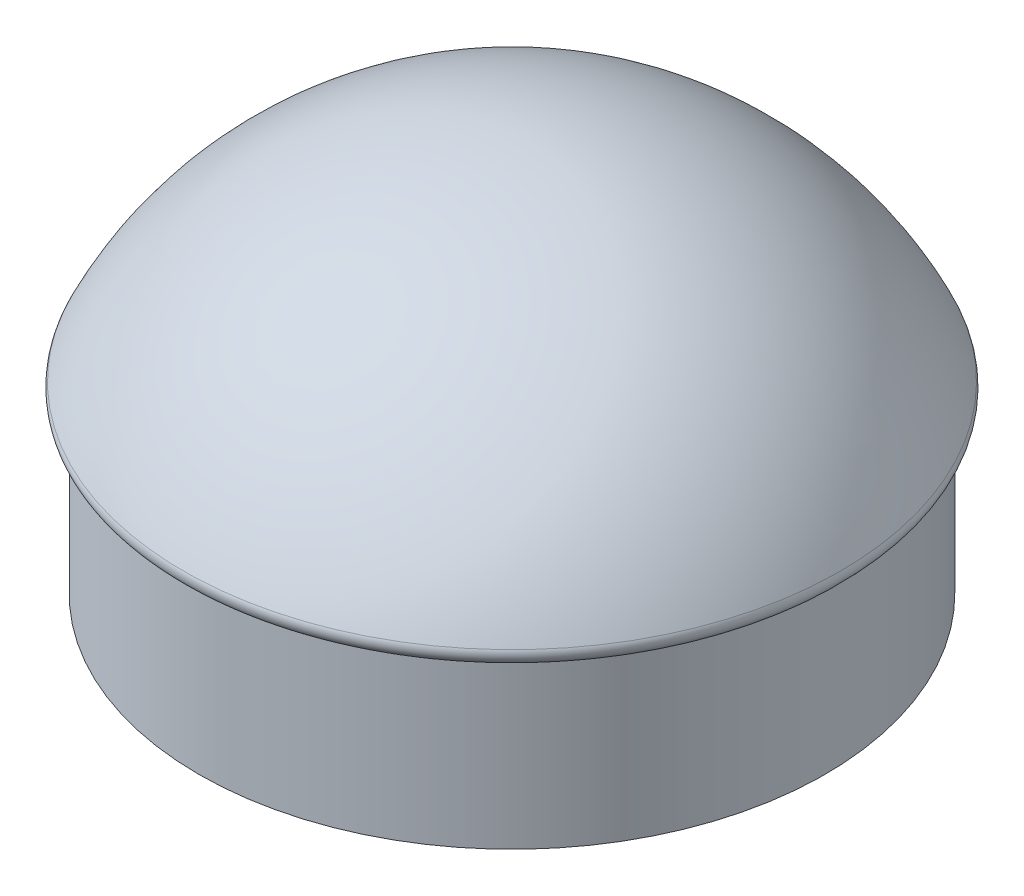
ISO-10303-21;
HEADER;
FILE_DESCRIPTION(('STEP AP214'),'2;1');
FILE_NAME('part.step','',(''),(''),'','','');
FILE_SCHEMA(('AUTOMOTIVE_DESIGN { 1 0 10303 214 1 1 1 1 }'));
ENDSEC;
DATA;
#1=APPLICATION_CONTEXT('core data for automotive mechanical design processes');
#2=APPLICATION_PROTOCOL_DEFINITION('international standard','automotive_design',2000,#1);
#3=PRODUCT_CONTEXT('',#1,'mechanical');
#4=PRODUCT('Part','Part','',(#3));
#5=PRODUCT_RELATED_PRODUCT_CATEGORY('part','',(#4));
#6=PRODUCT_DEFINITION_FORMATION('','',#4);
#7=PRODUCT_DEFINITION_CONTEXT('part definition',#1,'design');
#8=PRODUCT_DEFINITION('design','',#6,#7);
#9=PRODUCT_DEFINITION_SHAPE('','',#8);
#10=(LENGTH_UNIT() NAMED_UNIT(*) SI_UNIT(.MILLI.,.METRE.));
#11=(NAMED_UNIT(*) PLANE_ANGLE_UNIT() SI_UNIT($,.RADIAN.));
#12=(NAMED_UNIT(*) SI_UNIT($,.STERADIAN.) SOLID_ANGLE_UNIT());
#13=UNCERTAINTY_MEASURE_WITH_UNIT(LENGTH_MEASURE(1.E-05),#10,'distance_accuracy_value','');
#14=(GEOMETRIC_REPRESENTATION_CONTEXT(3) GLOBAL_UNCERTAINTY_ASSIGNED_CONTEXT((#13)) GLOBAL_UNIT_ASSIGNED_CONTEXT((#10,
#11,#12)) REPRESENTATION_CONTEXT('',''));
#15=CARTESIAN_POINT('',(0.,0.,0.));
#16=DIRECTION('',(0.,0.,1.));
#17=DIRECTION('',(1.,0.,0.));
#18=AXIS2_PLACEMENT_3D('',#15,#16,#17);
#19=CARTESIAN_POINT('',(0.,75.,0.));
#20=DIRECTION('',(0.,-1.,0.));
#21=DIRECTION('',(0.,0.,-1.));
#22=AXIS2_PLACEMENT_3D('',#19,#20,#21);
#23=CYLINDRICAL_SURFACE('',#22,140.);
#24=CARTESIAN_POINT('',(0.,75.,0.));
#25=DIRECTION('',(0.,1.,0.));
#26=DIRECTION('',(0.,0.,1.));
#27=AXIS2_PLACEMENT_3D('',#24,#25,#26);
#28=CIRCLE('',#27,140.);
#29=CARTESIAN_POINT('',(0.,75.,140.));
#30=VERTEX_POINT('',#29);
#31=EDGE_CURVE('E11',#30,#30,#28,.T.);
#32=ORIENTED_EDGE('',*,*,#31,.F.);
#33=EDGE_LOOP('',(#32));
#34=FACE_BOUND('',#33,.T.);
#35=CARTESIAN_POINT('',(0.,0.,0.));
#36=DIRECTION('',(0.,1.,0.));
#37=DIRECTION('',(0.,0.,1.));
#38=AXIS2_PLACEMENT_3D('',#35,#36,#37);
#39=CIRCLE('',#38,140.);
#40=CARTESIAN_POINT('',(0.,0.,140.));
#41=VERTEX_POINT('',#40);
#42=EDGE_CURVE('E50',#41,#41,#39,.T.);
#43=ORIENTED_EDGE('',*,*,#42,.T.);
#44=EDGE_LOOP('',(#43));
#45=FACE_BOUND('',#44,.T.);
#46=ADVANCED_FACE('F47',(#34,#45),#23,.T.);
#47=CARTESIAN_POINT('',(0.,0.,0.));
#48=DIRECTION('',(0.,1.,0.));
#49=DIRECTION('',(0.,0.,1.));
#50=AXIS2_PLACEMENT_3D('',#47,#48,#49);
#51=PLANE('',#50);
#52=ORIENTED_EDGE('',*,*,#42,.F.);
#53=EDGE_LOOP('',(#52));
#54=FACE_BOUND('',#53,.T.);
#55=ADVANCED_FACE('F70',(#54),#51,.F.);
#56=CARTESIAN_POINT('',(0.,75.,0.));
#57=DIRECTION('',(0.,-1.,0.));
#58=DIRECTION('',(0.,0.,-1.));
#59=AXIS2_PLACEMENT_3D('',#56,#57,#58);
#60=PLANE('',#59);
#61=ORIENTED_EDGE('',*,*,#31,.T.);
#62=EDGE_LOOP('',(#61));
#63=FACE_BOUND('',#62,.T.);
#64=CARTESIAN_POINT('',(0.,75.,0.));
#65=DIRECTION('',(0.,-1.,0.));
#66=DIRECTION('',(0.,0.,-1.));
#67=AXIS2_PLACEMENT_3D('',#64,#65,#66);
#68=CIRCLE('',#67,142.327267003282);
#69=CARTESIAN_POINT('',(0.,75.,-142.327267003282));
#70=VERTEX_POINT('',#69);
#71=EDGE_CURVE('E81',#70,#70,#68,.T.);
#72=ORIENTED_EDGE('',*,*,#71,.T.);
#73=EDGE_LOOP('',(#72));
#74=FACE_BOUND('',#73,.T.);
#75=ADVANCED_FACE('F65',(#63,#74),#60,.T.);
#76=CARTESIAN_POINT('',(0.,80.,0.));
#77=DIRECTION('',(0.,-1.,0.));
#78=DIRECTION('',(0.,0.,-1.));
#79=AXIS2_PLACEMENT_3D('',#76,#77,#78);
#80=TOROIDAL_SURFACE('',#79,142.327267003282,5.00000000000006);
#81=CARTESIAN_POINT('',(0.,82.1296813612479,0.));
#82=DIRECTION('',(0.,-1.,0.));
#83=DIRECTION('',(0.,0.,-1.));
#84=AXIS2_PLACEMENT_3D('',#81,#82,#83);
#85=CIRCLE('',#84,146.851032834927);
#86=CARTESIAN_POINT('',(0.,82.1296813612479,-146.851032834927));
#87=VERTEX_POINT('',#86);
#88=EDGE_CURVE('E84',#87,#87,#85,.T.);
#89=ORIENTED_EDGE('',*,*,#88,.T.);
#90=EDGE_LOOP('',(#89));
#91=FACE_BOUND('',#90,.T.);
#92=ORIENTED_EDGE('',*,*,#71,.F.);
#93=EDGE_LOOP('',(#92));
#94=FACE_BOUND('',#93,.T.);
#95=ADVANCED_FACE('F59',(#91,#94),#80,.T.);
#96=CARTESIAN_POINT('',(0.,13.2224489721741,-0.481632648116764));
#97=DIRECTION('',(-1.,0.,0.));
#98=DIRECTION('',(0.,0.,-1.));
#99=AXIS2_PLACEMENT_3D('',#96,#97,#98);
#100=CIRCLE('',#99,161.778267967513);
#101=TRIMMED_CURVE('',#100,(PARAMETER_VALUE(-1.57377344705734)),
(PARAMETER_VALUE(1.57377344705734)),.T.,.PARAMETER.);
#102=CARTESIAN_POINT('',(0.,13.2224489721741,0.));
#103=DIRECTION('',(0.,-1.,0.));
#104=AXIS1_PLACEMENT('',#102,#103);
#105=SURFACE_OF_REVOLUTION('',#101,#104);
#106=ORIENTED_EDGE('',*,*,#88,.F.);
#107=EDGE_LOOP('',(#106));
#108=FACE_BOUND('',#107,.T.);
#109=CARTESIAN_POINT('',(0.,174.999999999999,0.));
#110=VERTEX_POINT('',#109);
#111=VERTEX_LOOP('',#110);
#112=FACE_BOUND('',#111,.T.);
#113=ADVANCED_FACE('F57',(#108,#112),#105,.T.);
#114=CLOSED_SHELL('',(#46,#55,#75,#95,#113));
#115=MANIFOLD_SOLID_BREP('B2',#114);
#116=ADVANCED_BREP_SHAPE_REPRESENTATION('',(#18,#115),#14);
#117=SHAPE_DEFINITION_REPRESENTATION(#9,#116);
ENDSEC;
END-ISO-10303-21;
